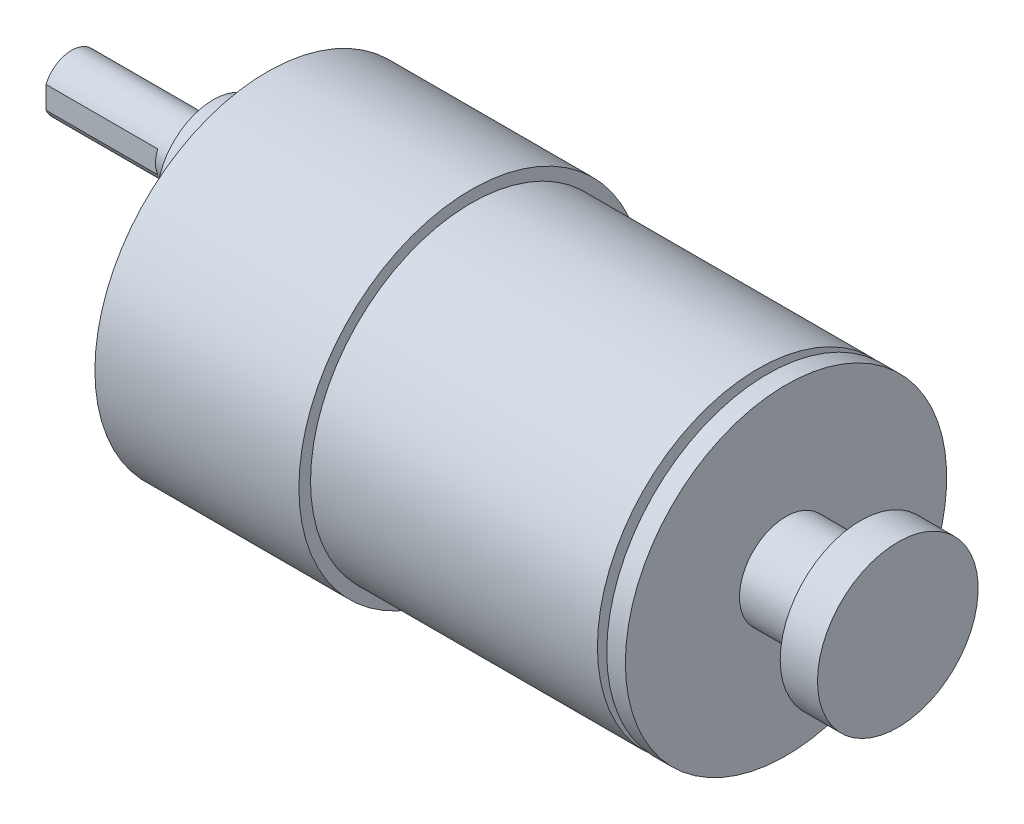
ISO-10303-21;
HEADER;
FILE_DESCRIPTION(('STEP AP214'),'2;1');
FILE_NAME('part.step','',(''),(''),'','','');
FILE_SCHEMA(('AUTOMOTIVE_DESIGN { 1 0 10303 214 1 1 1 1 }'));
ENDSEC;
DATA;
#1=APPLICATION_CONTEXT('core data for automotive mechanical design processes');
#2=APPLICATION_PROTOCOL_DEFINITION('international standard','automotive_design',2000,#1);
#3=PRODUCT_CONTEXT('',#1,'mechanical');
#4=PRODUCT('Part','Part','',(#3));
#5=PRODUCT_RELATED_PRODUCT_CATEGORY('part','',(#4));
#6=PRODUCT_DEFINITION_FORMATION('','',#4);
#7=PRODUCT_DEFINITION_CONTEXT('part definition',#1,'design');
#8=PRODUCT_DEFINITION('design','',#6,#7);
#9=PRODUCT_DEFINITION_SHAPE('','',#8);
#10=(LENGTH_UNIT() NAMED_UNIT(*) SI_UNIT(.MILLI.,.METRE.));
#11=(NAMED_UNIT(*) PLANE_ANGLE_UNIT() SI_UNIT($,.RADIAN.));
#12=(NAMED_UNIT(*) SI_UNIT($,.STERADIAN.) SOLID_ANGLE_UNIT());
#13=UNCERTAINTY_MEASURE_WITH_UNIT(LENGTH_MEASURE(1.E-05),#10,'distance_accuracy_value','');
#14=(GEOMETRIC_REPRESENTATION_CONTEXT(3) GLOBAL_UNCERTAINTY_ASSIGNED_CONTEXT((#13)) GLOBAL_UNIT_ASSIGNED_CONTEXT((#10,
#11,#12)) REPRESENTATION_CONTEXT('',''));
#15=CARTESIAN_POINT('',(0.,0.,0.));
#16=DIRECTION('',(0.,0.,1.));
#17=DIRECTION('',(1.,0.,0.));
#18=AXIS2_PLACEMENT_3D('',#15,#16,#17);
#19=CARTESIAN_POINT('',(-67.7,18.5,0.));
#20=DIRECTION('',(1.,0.,0.));
#21=DIRECTION('',(0.,0.,-1.));
#22=AXIS2_PLACEMENT_3D('',#19,#20,#21);
#23=PLANE('',#22);
#24=CARTESIAN_POINT('',(-67.7,0.,0.));
#25=DIRECTION('',(-1.,0.,0.));
#26=DIRECTION('',(0.,0.,1.));
#27=AXIS2_PLACEMENT_3D('',#24,#25,#26);
#28=CIRCLE('',#27,18.5);
#29=CARTESIAN_POINT('',(-67.7,0.,18.5));
#30=VERTEX_POINT('',#29);
#31=EDGE_CURVE('E207',#30,#30,#28,.T.);
#32=ORIENTED_EDGE('',*,*,#31,.T.);
#33=EDGE_LOOP('',(#32));
#34=FACE_BOUND('',#33,.T.);
#35=CARTESIAN_POINT('',(-67.7,6.99999999999999,0.));
#36=DIRECTION('',(1.,0.,0.));
#37=DIRECTION('',(0.,1.,0.));
#38=AXIS2_PLACEMENT_3D('',#35,#36,#37);
#39=CIRCLE('',#38,6.);
#40=CARTESIAN_POINT('',(-67.7,13.,0.));
#41=VERTEX_POINT('',#40);
#42=EDGE_CURVE('E204',#41,#41,#39,.T.);
#43=ORIENTED_EDGE('',*,*,#42,.T.);
#44=EDGE_LOOP('',(#43));
#45=FACE_BOUND('',#44,.T.);
#46=CARTESIAN_POINT('',(-67.7,13.4233937586587,7.75000000000016));
#47=DIRECTION('',(-1.,0.,0.));
#48=DIRECTION('',(0.,0.,1.));
#49=AXIS2_PLACEMENT_3D('',#46,#47,#48);
#50=CIRCLE('',#49,1.24999999999999);
#51=CARTESIAN_POINT('',(-67.7,13.4233937586587,9.00000000000015));
#52=VERTEX_POINT('',#51);
#53=EDGE_CURVE('E165',#52,#52,#50,.T.);
#54=ORIENTED_EDGE('',*,*,#53,.F.);
#55=EDGE_LOOP('',(#54));
#56=FACE_BOUND('',#55,.T.);
#57=CARTESIAN_POINT('',(-67.7,13.4233937586589,-7.74999999999987));
#58=DIRECTION('',(-1.,0.,0.));
#59=DIRECTION('',(0.,0.,1.));
#60=AXIS2_PLACEMENT_3D('',#57,#58,#59);
#61=CIRCLE('',#60,1.24999999999999);
#62=CARTESIAN_POINT('',(-67.7,13.4233937586589,-6.49999999999989));
#63=VERTEX_POINT('',#62);
#64=EDGE_CURVE('E159',#63,#63,#61,.T.);
#65=ORIENTED_EDGE('',*,*,#64,.F.);
#66=EDGE_LOOP('',(#65));
#67=FACE_BOUND('',#66,.T.);
#68=CARTESIAN_POINT('',(-67.7,1.08235921504137E-13,-15.5));
#69=DIRECTION('',(-1.,0.,0.));
#70=DIRECTION('',(0.,0.,1.));
#71=AXIS2_PLACEMENT_3D('',#68,#69,#70);
#72=CIRCLE('',#71,1.24999999999999);
#73=CARTESIAN_POINT('',(-67.7,1.08235921504137E-13,-14.25));
#74=VERTEX_POINT('',#73);
#75=EDGE_CURVE('E153',#74,#74,#72,.T.);
#76=ORIENTED_EDGE('',*,*,#75,.F.);
#77=EDGE_LOOP('',(#76));
#78=FACE_BOUND('',#77,.T.);
#79=CARTESIAN_POINT('',(-67.7,-13.4233937586588,-7.75000000000006));
#80=DIRECTION('',(-1.,0.,0.));
#81=DIRECTION('',(0.,0.,1.));
#82=AXIS2_PLACEMENT_3D('',#79,#80,#81);
#83=CIRCLE('',#82,1.24999999999999);
#84=CARTESIAN_POINT('',(-67.7,-13.4233937586588,-6.50000000000007));
#85=VERTEX_POINT('',#84);
#86=EDGE_CURVE('E147',#85,#85,#83,.T.);
#87=ORIENTED_EDGE('',*,*,#86,.F.);
#88=EDGE_LOOP('',(#87));
#89=FACE_BOUND('',#88,.T.);
#90=CARTESIAN_POINT('',(-67.7,-13.4233937586588,7.74999999999997));
#91=DIRECTION('',(-1.,0.,0.));
#92=DIRECTION('',(0.,0.,1.));
#93=AXIS2_PLACEMENT_3D('',#90,#91,#92);
#94=CIRCLE('',#93,1.24999999999999);
#95=CARTESIAN_POINT('',(-67.7,-13.4233937586588,8.99999999999996));
#96=VERTEX_POINT('',#95);
#97=EDGE_CURVE('E141',#96,#96,#94,.T.);
#98=ORIENTED_EDGE('',*,*,#97,.F.);
#99=EDGE_LOOP('',(#98));
#100=FACE_BOUND('',#99,.T.);
#101=CARTESIAN_POINT('',(-67.7,0.,15.5));
#102=DIRECTION('',(-1.,0.,0.));
#103=DIRECTION('',(0.,0.,1.));
#104=AXIS2_PLACEMENT_3D('',#101,#102,#103);
#105=CIRCLE('',#104,1.24999999999999);
#106=CARTESIAN_POINT('',(-67.7,0.,16.75));
#107=VERTEX_POINT('',#106);
#108=EDGE_CURVE('E134',#107,#107,#105,.T.);
#109=ORIENTED_EDGE('',*,*,#108,.F.);
#110=EDGE_LOOP('',(#109));
#111=FACE_BOUND('',#110,.T.);
#112=CARTESIAN_POINT('',(-67.7,6.99999999999999,0.));
#113=DIRECTION('',(-1.,0.,0.));
#114=DIRECTION('',(0.,0.,1.));
#115=AXIS2_PLACEMENT_3D('',#112,#113,#114);
#116=CIRCLE('',#115,9.34506746263185);
#117=CARTESIAN_POINT('',(-67.7,6.38547070420546,-9.32483992493977));
#118=VERTEX_POINT('',#117);
#119=CARTESIAN_POINT('',(-67.7,6.38547070420546,9.32483992493977));
#120=VERTEX_POINT('',#119);
#121=EDGE_CURVE('E59',#118,#120,#116,.T.);
#122=ORIENTED_EDGE('',*,*,#121,.T.);
#123=CARTESIAN_POINT('',(-67.7,0.,0.));
#124=DIRECTION('',(-1.,0.,0.));
#125=DIRECTION('',(0.,0.,1.));
#126=AXIS2_PLACEMENT_3D('',#123,#124,#125);
#127=CIRCLE('',#126,11.3016315521263);
#128=EDGE_CURVE('E127',#118,#120,#127,.T.);
#129=ORIENTED_EDGE('',*,*,#128,.F.);
#130=EDGE_LOOP('',(#122,#129));
#131=FACE_BOUND('',#130,.T.);
#132=ADVANCED_FACE('F44',(#34,#45,#56,#67,#78,#89,#100,#111,#131),#23,.F.);
#133=CARTESIAN_POINT('',(0.,7.,0.));
#134=DIRECTION('',(1.,0.,0.));
#135=DIRECTION('',(0.,1.,0.));
#136=AXIS2_PLACEMENT_3D('',#133,#134,#135);
#137=CYLINDRICAL_SURFACE('',#136,3.);
#138=CARTESIAN_POINT('',(-73.5,6.99999999999999,0.));
#139=DIRECTION('',(1.,0.,0.));
#140=DIRECTION('',(0.,1.,0.));
#141=AXIS2_PLACEMENT_3D('',#138,#139,#140);
#142=CIRCLE('',#141,3.);
#143=CARTESIAN_POINT('',(-73.5,9.99999999999999,0.));
#144=VERTEX_POINT('',#143);
#145=EDGE_CURVE('E198',#144,#144,#142,.T.);
#146=ORIENTED_EDGE('',*,*,#145,.F.);
#147=EDGE_LOOP('',(#146));
#148=FACE_BOUND('',#147,.T.);
#149=CARTESIAN_POINT('',(-76.7,6.99999999999999,0.));
#150=DIRECTION('',(-1.,0.,0.));
#151=DIRECTION('',(0.,0.,1.));
#152=AXIS2_PLACEMENT_3D('',#149,#150,#151);
#153=CIRCLE('',#152,3.);
#154=CARTESIAN_POINT('',(-76.7,8.19895788082817,-2.75));
#155=VERTEX_POINT('',#154);
#156=CARTESIAN_POINT('',(-76.7,5.80104211917181,-2.75));
#157=VERTEX_POINT('',#156);
#158=EDGE_CURVE('E174',#155,#157,#153,.T.);
#159=ORIENTED_EDGE('',*,*,#158,.F.);
#160=DIRECTION('',(-1.,0.,0.));
#161=VECTOR('',#160,1.);
#162=CARTESIAN_POINT('',(-76.7,8.19895788082817,-2.75));
#163=LINE('',#162,#161);
#164=CARTESIAN_POINT('',(-88.7,8.19895788082817,-2.75));
#165=VERTEX_POINT('',#164);
#166=EDGE_CURVE('E178',#155,#165,#163,.T.);
#167=ORIENTED_EDGE('',*,*,#166,.T.);
#168=CARTESIAN_POINT('',(-88.7,6.99999999999999,0.));
#169=DIRECTION('',(1.,0.,0.));
#170=DIRECTION('',(0.,1.,0.));
#171=AXIS2_PLACEMENT_3D('',#168,#169,#170);
#172=CIRCLE('',#171,3.);
#173=CARTESIAN_POINT('',(-88.7,8.19895788082817,2.75));
#174=VERTEX_POINT('',#173);
#175=EDGE_CURVE('E182',#165,#174,#172,.T.);
#176=ORIENTED_EDGE('',*,*,#175,.T.);
#177=DIRECTION('',(-1.,0.,0.));
#178=VECTOR('',#177,1.);
#179=CARTESIAN_POINT('',(-76.7,8.19895788082817,2.75));
#180=LINE('',#179,#178);
#181=CARTESIAN_POINT('',(-76.7,8.19895788082817,2.75));
#182=VERTEX_POINT('',#181);
#183=EDGE_CURVE('E190',#182,#174,#180,.T.);
#184=ORIENTED_EDGE('',*,*,#183,.F.);
#185=CARTESIAN_POINT('',(-76.7,6.99999999999999,0.));
#186=DIRECTION('',(-1.,0.,0.));
#187=DIRECTION('',(0.,0.,1.));
#188=AXIS2_PLACEMENT_3D('',#185,#186,#187);
#189=CIRCLE('',#188,3.);
#190=CARTESIAN_POINT('',(-76.7,5.80104211917181,2.75));
#191=VERTEX_POINT('',#190);
#192=EDGE_CURVE('E185',#191,#182,#189,.T.);
#193=ORIENTED_EDGE('',*,*,#192,.F.);
#194=DIRECTION('',(-1.,0.,0.));
#195=VECTOR('',#194,1.);
#196=CARTESIAN_POINT('',(-76.7,5.80104211917181,2.75));
#197=LINE('',#196,#195);
#198=CARTESIAN_POINT('',(-88.7,5.80104211917181,2.75));
#199=VERTEX_POINT('',#198);
#200=EDGE_CURVE('E180',#191,#199,#197,.T.);
#201=ORIENTED_EDGE('',*,*,#200,.T.);
#202=CARTESIAN_POINT('',(-88.7,5.80104211917181,-2.75));
#203=VERTEX_POINT('',#202);
#204=EDGE_CURVE('E197',#199,#203,#172,.T.);
#205=ORIENTED_EDGE('',*,*,#204,.T.);
#206=DIRECTION('',(-1.,0.,0.));
#207=VECTOR('',#206,1.);
#208=CARTESIAN_POINT('',(-76.7,5.80104211917181,-2.75));
#209=LINE('',#208,#207);
#210=EDGE_CURVE('E67',#157,#203,#209,.T.);
#211=ORIENTED_EDGE('',*,*,#210,.F.);
#212=EDGE_LOOP('',(#159,#167,#176,#184,#193,#201,#205,#211));
#213=FACE_BOUND('',#212,.T.);
#214=ADVANCED_FACE('F251',(#148,#213),#137,.T.);
#215=CARTESIAN_POINT('',(-88.7,9.99999999999999,0.));
#216=DIRECTION('',(-1.,0.,0.));
#217=DIRECTION('',(0.,-1.,0.));
#218=AXIS2_PLACEMENT_3D('',#215,#216,#217);
#219=PLANE('',#218);
#220=ORIENTED_EDGE('',*,*,#175,.F.);
#221=DIRECTION('',(0.,-1.,0.));
#222=VECTOR('',#221,1.);
#223=CARTESIAN_POINT('',(-88.7,0.,-2.75));
#224=LINE('',#223,#222);
#225=EDGE_CURVE('E175',#165,#203,#224,.T.);
#226=ORIENTED_EDGE('',*,*,#225,.T.);
#227=ORIENTED_EDGE('',*,*,#204,.F.);
#228=DIRECTION('',(0.,-1.,0.));
#229=VECTOR('',#228,1.);
#230=CARTESIAN_POINT('',(-88.7,0.,2.75));
#231=LINE('',#230,#229);
#232=EDGE_CURVE('E171',#174,#199,#231,.T.);
#233=ORIENTED_EDGE('',*,*,#232,.F.);
#234=EDGE_LOOP('',(#220,#226,#227,#233));
#235=FACE_BOUND('',#234,.T.);
#236=ADVANCED_FACE('F247',(#235),#219,.T.);
#237=CARTESIAN_POINT('',(0.,0.,0.));
#238=DIRECTION('',(-1.,0.,0.));
#239=DIRECTION('',(0.,0.,1.));
#240=AXIS2_PLACEMENT_3D('',#237,#238,#239);
#241=PLANE('',#240);
#242=CARTESIAN_POINT('',(0.,0.,0.));
#243=DIRECTION('',(-1.,0.,0.));
#244=DIRECTION('',(0.,0.,1.));
#245=AXIS2_PLACEMENT_3D('',#242,#243,#244);
#246=CIRCLE('',#245,8.625);
#247=CARTESIAN_POINT('',(0.,0.,8.625));
#248=VERTEX_POINT('',#247);
#249=EDGE_CURVE('E11',#248,#248,#246,.T.);
#250=ORIENTED_EDGE('',*,*,#249,.F.);
#251=EDGE_LOOP('',(#250));
#252=FACE_BOUND('',#251,.T.);
#253=ADVANCED_FACE('F46',(#252),#241,.F.);
#254=CARTESIAN_POINT('',(-80.111398028132,0.,0.));
#255=DIRECTION('',(-1.,0.,0.));
#256=DIRECTION('',(0.,0.,1.));
#257=AXIS2_PLACEMENT_3D('',#254,#255,#256);
#258=CYLINDRICAL_SURFACE('',#257,8.625);
#259=CARTESIAN_POINT('',(-4.,0.,0.));
#260=DIRECTION('',(-1.,0.,0.));
#261=DIRECTION('',(0.,0.,1.));
#262=AXIS2_PLACEMENT_3D('',#259,#260,#261);
#263=CIRCLE('',#262,8.625);
#264=CARTESIAN_POINT('',(-4.,0.,8.625));
#265=VERTEX_POINT('',#264);
#266=EDGE_CURVE('E52',#265,#265,#263,.T.);
#267=ORIENTED_EDGE('',*,*,#266,.F.);
#268=EDGE_LOOP('',(#267));
#269=FACE_BOUND('',#268,.T.);
#270=ORIENTED_EDGE('',*,*,#249,.T.);
#271=EDGE_LOOP('',(#270));
#272=FACE_BOUND('',#271,.T.);
#273=ADVANCED_FACE('F241',(#269,#272),#258,.T.);
#274=CARTESIAN_POINT('',(-4.,8.625,0.));
#275=DIRECTION('',(1.,0.,0.));
#276=DIRECTION('',(0.,0.,-1.));
#277=AXIS2_PLACEMENT_3D('',#274,#275,#276);
#278=PLANE('',#277);
#279=CARTESIAN_POINT('',(-4.,0.,0.));
#280=DIRECTION('',(-1.,0.,0.));
#281=DIRECTION('',(0.,0.,1.));
#282=AXIS2_PLACEMENT_3D('',#279,#280,#281);
#283=CIRCLE('',#282,5.);
#284=CARTESIAN_POINT('',(-4.,0.,5.));
#285=VERTEX_POINT('',#284);
#286=EDGE_CURVE('E234',#285,#285,#283,.T.);
#287=ORIENTED_EDGE('',*,*,#286,.F.);
#288=EDGE_LOOP('',(#287));
#289=FACE_BOUND('',#288,.T.);
#290=ORIENTED_EDGE('',*,*,#266,.T.);
#291=EDGE_LOOP('',(#290));
#292=FACE_BOUND('',#291,.T.);
#293=ADVANCED_FACE('F239',(#289,#292),#278,.F.);
#294=CARTESIAN_POINT('',(-80.111398028132,0.,0.));
#295=DIRECTION('',(-1.,0.,0.));
#296=DIRECTION('',(0.,0.,1.));
#297=AXIS2_PLACEMENT_3D('',#294,#295,#296);
#298=CYLINDRICAL_SURFACE('',#297,5.);
#299=CARTESIAN_POINT('',(-12.,0.,0.));
#300=DIRECTION('',(-1.,0.,0.));
#301=DIRECTION('',(0.,0.,1.));
#302=AXIS2_PLACEMENT_3D('',#299,#300,#301);
#303=CIRCLE('',#302,5.);
#304=CARTESIAN_POINT('',(-12.,0.,5.));
#305=VERTEX_POINT('',#304);
#306=EDGE_CURVE('E231',#305,#305,#303,.T.);
#307=ORIENTED_EDGE('',*,*,#306,.F.);
#308=EDGE_LOOP('',(#307));
#309=FACE_BOUND('',#308,.T.);
#310=ORIENTED_EDGE('',*,*,#286,.T.);
#311=EDGE_LOOP('',(#310));
#312=FACE_BOUND('',#311,.T.);
#313=ADVANCED_FACE('F298',(#309,#312),#298,.T.);
#314=CARTESIAN_POINT('',(-12.,5.,0.));
#315=DIRECTION('',(-1.,0.,0.));
#316=DIRECTION('',(0.,0.,1.));
#317=AXIS2_PLACEMENT_3D('',#314,#315,#316);
#318=PLANE('',#317);
#319=CARTESIAN_POINT('',(-12.,0.,0.));
#320=DIRECTION('',(-1.,0.,0.));
#321=DIRECTION('',(0.,0.,1.));
#322=AXIS2_PLACEMENT_3D('',#319,#320,#321);
#323=CIRCLE('',#322,17.25);
#324=CARTESIAN_POINT('',(-12.,0.,17.25));
#325=VERTEX_POINT('',#324);
#326=EDGE_CURVE('E228',#325,#325,#323,.T.);
#327=ORIENTED_EDGE('',*,*,#326,.F.);
#328=EDGE_LOOP('',(#327));
#329=FACE_BOUND('',#328,.T.);
#330=ORIENTED_EDGE('',*,*,#306,.T.);
#331=EDGE_LOOP('',(#330));
#332=FACE_BOUND('',#331,.T.);
#333=ADVANCED_FACE('F294',(#329,#332),#318,.F.);
#334=CARTESIAN_POINT('',(-80.111398028132,0.,0.));
#335=DIRECTION('',(-1.,0.,0.));
#336=DIRECTION('',(0.,0.,1.));
#337=AXIS2_PLACEMENT_3D('',#334,#335,#336);
#338=CYLINDRICAL_SURFACE('',#337,17.25);
#339=CARTESIAN_POINT('',(-14.,0.,0.));
#340=DIRECTION('',(-1.,0.,0.));
#341=DIRECTION('',(0.,0.,1.));
#342=AXIS2_PLACEMENT_3D('',#339,#340,#341);
#343=CIRCLE('',#342,17.25);
#344=CARTESIAN_POINT('',(-14.,0.,17.25));
#345=VERTEX_POINT('',#344);
#346=EDGE_CURVE('E225',#345,#345,#343,.T.);
#347=ORIENTED_EDGE('',*,*,#346,.F.);
#348=EDGE_LOOP('',(#347));
#349=FACE_BOUND('',#348,.T.);
#350=ORIENTED_EDGE('',*,*,#326,.T.);
#351=EDGE_LOOP('',(#350));
#352=FACE_BOUND('',#351,.T.);
#353=ADVANCED_FACE('F290',(#349,#352),#338,.T.);
#354=CARTESIAN_POINT('',(-14.,17.25,0.));
#355=DIRECTION('',(1.,0.,0.));
#356=DIRECTION('',(0.,0.,-1.));
#357=AXIS2_PLACEMENT_3D('',#354,#355,#356);
#358=PLANE('',#357);
#359=CARTESIAN_POINT('',(-14.,0.,0.));
#360=DIRECTION('',(-1.,0.,0.));
#361=DIRECTION('',(0.,0.,1.));
#362=AXIS2_PLACEMENT_3D('',#359,#360,#361);
#363=CIRCLE('',#362,5.);
#364=CARTESIAN_POINT('',(-14.,0.,5.));
#365=VERTEX_POINT('',#364);
#366=EDGE_CURVE('E222',#365,#365,#363,.T.);
#367=ORIENTED_EDGE('',*,*,#366,.F.);
#368=EDGE_LOOP('',(#367));
#369=FACE_BOUND('',#368,.T.);
#370=ORIENTED_EDGE('',*,*,#346,.T.);
#371=EDGE_LOOP('',(#370));
#372=FACE_BOUND('',#371,.T.);
#373=ADVANCED_FACE('F286',(#369,#372),#358,.F.);
#374=CARTESIAN_POINT('',(-80.111398028132,0.,0.));
#375=DIRECTION('',(-1.,0.,0.));
#376=DIRECTION('',(0.,0.,1.));
#377=AXIS2_PLACEMENT_3D('',#374,#375,#376);
#378=CYLINDRICAL_SURFACE('',#377,5.);
#379=CARTESIAN_POINT('',(-15.,0.,0.));
#380=DIRECTION('',(-1.,0.,0.));
#381=DIRECTION('',(0.,0.,1.));
#382=AXIS2_PLACEMENT_3D('',#379,#380,#381);
#383=CIRCLE('',#382,5.);
#384=CARTESIAN_POINT('',(-15.,0.,5.));
#385=VERTEX_POINT('',#384);
#386=EDGE_CURVE('E219',#385,#385,#383,.T.);
#387=ORIENTED_EDGE('',*,*,#386,.F.);
#388=EDGE_LOOP('',(#387));
#389=FACE_BOUND('',#388,.T.);
#390=ORIENTED_EDGE('',*,*,#366,.T.);
#391=EDGE_LOOP('',(#390));
#392=FACE_BOUND('',#391,.T.);
#393=ADVANCED_FACE('F282',(#389,#392),#378,.T.);
#394=CARTESIAN_POINT('',(-15.,5.,0.));
#395=DIRECTION('',(-1.,0.,0.));
#396=DIRECTION('',(0.,0.,1.));
#397=AXIS2_PLACEMENT_3D('',#394,#395,#396);
#398=PLANE('',#397);
#399=CARTESIAN_POINT('',(-15.,0.,0.));
#400=DIRECTION('',(-1.,0.,0.));
#401=DIRECTION('',(0.,0.,1.));
#402=AXIS2_PLACEMENT_3D('',#399,#400,#401);
#403=CIRCLE('',#402,17.25);
#404=CARTESIAN_POINT('',(-15.,0.,17.25));
#405=VERTEX_POINT('',#404);
#406=EDGE_CURVE('E216',#405,#405,#403,.T.);
#407=ORIENTED_EDGE('',*,*,#406,.F.);
#408=EDGE_LOOP('',(#407));
#409=FACE_BOUND('',#408,.T.);
#410=ORIENTED_EDGE('',*,*,#386,.T.);
#411=EDGE_LOOP('',(#410));
#412=FACE_BOUND('',#411,.T.);
#413=ADVANCED_FACE('F278',(#409,#412),#398,.F.);
#414=CARTESIAN_POINT('',(-80.111398028132,0.,0.));
#415=DIRECTION('',(-1.,0.,0.));
#416=DIRECTION('',(0.,0.,1.));
#417=AXIS2_PLACEMENT_3D('',#414,#415,#416);
#418=CYLINDRICAL_SURFACE('',#417,17.25);
#419=CARTESIAN_POINT('',(-45.8,0.,0.));
#420=DIRECTION('',(-1.,0.,0.));
#421=DIRECTION('',(0.,0.,1.));
#422=AXIS2_PLACEMENT_3D('',#419,#420,#421);
#423=CIRCLE('',#422,17.25);
#424=CARTESIAN_POINT('',(-45.8,0.,17.25));
#425=VERTEX_POINT('',#424);
#426=EDGE_CURVE('E213',#425,#425,#423,.T.);
#427=ORIENTED_EDGE('',*,*,#426,.F.);
#428=EDGE_LOOP('',(#427));
#429=FACE_BOUND('',#428,.T.);
#430=ORIENTED_EDGE('',*,*,#406,.T.);
#431=EDGE_LOOP('',(#430));
#432=FACE_BOUND('',#431,.T.);
#433=ADVANCED_FACE('F274',(#429,#432),#418,.T.);
#434=CARTESIAN_POINT('',(-45.8,17.25,0.));
#435=DIRECTION('',(-1.,0.,0.));
#436=DIRECTION('',(0.,0.,1.));
#437=AXIS2_PLACEMENT_3D('',#434,#435,#436);
#438=PLANE('',#437);
#439=CARTESIAN_POINT('',(-45.8,0.,0.));
#440=DIRECTION('',(-1.,0.,0.));
#441=DIRECTION('',(0.,0.,1.));
#442=AXIS2_PLACEMENT_3D('',#439,#440,#441);
#443=CIRCLE('',#442,18.5);
#444=CARTESIAN_POINT('',(-45.8,0.,18.5));
#445=VERTEX_POINT('',#444);
#446=EDGE_CURVE('E210',#445,#445,#443,.T.);
#447=ORIENTED_EDGE('',*,*,#446,.F.);
#448=EDGE_LOOP('',(#447));
#449=FACE_BOUND('',#448,.T.);
#450=ORIENTED_EDGE('',*,*,#426,.T.);
#451=EDGE_LOOP('',(#450));
#452=FACE_BOUND('',#451,.T.);
#453=ADVANCED_FACE('F270',(#449,#452),#438,.F.);
#454=CARTESIAN_POINT('',(-80.111398028132,0.,0.));
#455=DIRECTION('',(-1.,0.,0.));
#456=DIRECTION('',(0.,0.,1.));
#457=AXIS2_PLACEMENT_3D('',#454,#455,#456);
#458=CYLINDRICAL_SURFACE('',#457,18.5);
#459=ORIENTED_EDGE('',*,*,#31,.F.);
#460=EDGE_LOOP('',(#459));
#461=FACE_BOUND('',#460,.T.);
#462=ORIENTED_EDGE('',*,*,#446,.T.);
#463=EDGE_LOOP('',(#462));
#464=FACE_BOUND('',#463,.T.);
#465=ADVANCED_FACE('F267',(#461,#464),#458,.T.);
#466=CARTESIAN_POINT('',(0.,7.,0.));
#467=DIRECTION('',(1.,0.,0.));
#468=DIRECTION('',(0.,1.,0.));
#469=AXIS2_PLACEMENT_3D('',#466,#467,#468);
#470=CYLINDRICAL_SURFACE('',#469,6.);
#471=CARTESIAN_POINT('',(-73.5,6.99999999999999,0.));
#472=DIRECTION('',(1.,0.,0.));
#473=DIRECTION('',(0.,1.,0.));
#474=AXIS2_PLACEMENT_3D('',#471,#472,#473);
#475=CIRCLE('',#474,6.);
#476=CARTESIAN_POINT('',(-73.5,13.,0.));
#477=VERTEX_POINT('',#476);
#478=EDGE_CURVE('E201',#477,#477,#475,.T.);
#479=ORIENTED_EDGE('',*,*,#478,.T.);
#480=EDGE_LOOP('',(#479));
#481=FACE_BOUND('',#480,.T.);
#482=ORIENTED_EDGE('',*,*,#42,.F.);
#483=EDGE_LOOP('',(#482));
#484=FACE_BOUND('',#483,.T.);
#485=ADVANCED_FACE('F265',(#481,#484),#470,.T.);
#486=CARTESIAN_POINT('',(-73.5,13.,0.));
#487=DIRECTION('',(-1.,0.,0.));
#488=DIRECTION('',(0.,-1.,0.));
#489=AXIS2_PLACEMENT_3D('',#486,#487,#488);
#490=PLANE('',#489);
#491=ORIENTED_EDGE('',*,*,#145,.T.);
#492=EDGE_LOOP('',(#491));
#493=FACE_BOUND('',#492,.T.);
#494=ORIENTED_EDGE('',*,*,#478,.F.);
#495=EDGE_LOOP('',(#494));
#496=FACE_BOUND('',#495,.T.);
#497=ADVANCED_FACE('F363',(#493,#496),#490,.T.);
#498=CARTESIAN_POINT('',(-76.7,0.,2.75));
#499=DIRECTION('',(0.,0.,-1.));
#500=DIRECTION('',(0.,1.,0.));
#501=AXIS2_PLACEMENT_3D('',#498,#499,#500);
#502=PLANE('',#501);
#503=ORIENTED_EDGE('',*,*,#232,.T.);
#504=ORIENTED_EDGE('',*,*,#200,.F.);
#505=DIRECTION('',(0.,-1.,0.));
#506=VECTOR('',#505,1.);
#507=CARTESIAN_POINT('',(-76.7,0.,2.75));
#508=LINE('',#507,#506);
#509=EDGE_CURVE('E187',#182,#191,#508,.T.);
#510=ORIENTED_EDGE('',*,*,#509,.F.);
#511=ORIENTED_EDGE('',*,*,#183,.T.);
#512=EDGE_LOOP('',(#503,#504,#510,#511));
#513=FACE_BOUND('',#512,.T.);
#514=ADVANCED_FACE('F369',(#513),#502,.F.);
#515=CARTESIAN_POINT('',(-76.7,0.,0.));
#516=DIRECTION('',(-1.,0.,0.));
#517=DIRECTION('',(0.,0.,1.));
#518=AXIS2_PLACEMENT_3D('',#515,#516,#517);
#519=PLANE('',#518);
#520=ORIENTED_EDGE('',*,*,#192,.T.);
#521=ORIENTED_EDGE('',*,*,#509,.T.);
#522=EDGE_LOOP('',(#520,#521));
#523=FACE_BOUND('',#522,.T.);
#524=ADVANCED_FACE('F375',(#523),#519,.T.);
#525=CARTESIAN_POINT('',(-76.7,0.,-2.75));
#526=DIRECTION('',(0.,0.,-1.));
#527=DIRECTION('',(0.,1.,0.));
#528=AXIS2_PLACEMENT_3D('',#525,#526,#527);
#529=PLANE('',#528);
#530=ORIENTED_EDGE('',*,*,#225,.F.);
#531=ORIENTED_EDGE('',*,*,#166,.F.);
#532=DIRECTION('',(0.,-1.,0.));
#533=VECTOR('',#532,1.);
#534=CARTESIAN_POINT('',(-76.7,0.,-2.75));
#535=LINE('',#534,#533);
#536=EDGE_CURVE('E172',#155,#157,#535,.T.);
#537=ORIENTED_EDGE('',*,*,#536,.T.);
#538=ORIENTED_EDGE('',*,*,#210,.T.);
#539=EDGE_LOOP('',(#530,#531,#537,#538));
#540=FACE_BOUND('',#539,.T.);
#541=ADVANCED_FACE('F383',(#540),#529,.T.);
#542=CARTESIAN_POINT('',(-76.7,0.,0.));
#543=DIRECTION('',(-1.,0.,0.));
#544=DIRECTION('',(0.,0.,1.));
#545=AXIS2_PLACEMENT_3D('',#542,#543,#544);
#546=PLANE('',#545);
#547=ORIENTED_EDGE('',*,*,#536,.F.);
#548=ORIENTED_EDGE('',*,*,#158,.T.);
#549=EDGE_LOOP('',(#547,#548));
#550=FACE_BOUND('',#549,.T.);
#551=ADVANCED_FACE('F391',(#550),#546,.T.);
#552=CARTESIAN_POINT('',(-59.2,13.4233937586587,7.75000000000016));
#553=DIRECTION('',(-1.,0.,0.));
#554=DIRECTION('',(0.,0.,1.));
#555=AXIS2_PLACEMENT_3D('',#552,#553,#554);
#556=CONICAL_SURFACE('',#555,1.25,1.02974425867665);
#557=CARTESIAN_POINT('',(-58.4489242262156,13.4233937586587,7.75000000000016));
#558=VERTEX_POINT('',#557);
#559=VERTEX_LOOP('',#558);
#560=FACE_BOUND('',#559,.T.);
#561=CARTESIAN_POINT('',(-59.2,13.4233937586587,7.75000000000016));
#562=DIRECTION('',(-1.,0.,0.));
#563=DIRECTION('',(0.,0.,1.));
#564=AXIS2_PLACEMENT_3D('',#561,#562,#563);
#565=CIRCLE('',#564,1.25);
#566=CARTESIAN_POINT('',(-59.2,13.4233937586587,9.00000000000016));
#567=VERTEX_POINT('',#566);
#568=EDGE_CURVE('E168',#567,#567,#565,.T.);
#569=ORIENTED_EDGE('',*,*,#568,.T.);
#570=EDGE_LOOP('',(#569));
#571=FACE_BOUND('',#570,.T.);
#572=ADVANCED_FACE('F398',(#560,#571),#556,.F.);
#573=CARTESIAN_POINT('',(-67.7,13.4233937586587,7.75000000000016));
#574=DIRECTION('',(-1.,0.,0.));
#575=DIRECTION('',(0.,0.,1.));
#576=AXIS2_PLACEMENT_3D('',#573,#574,#575);
#577=CYLINDRICAL_SURFACE('',#576,1.24999999999999);
#578=ORIENTED_EDGE('',*,*,#568,.F.);
#579=EDGE_LOOP('',(#578));
#580=FACE_BOUND('',#579,.T.);
#581=ORIENTED_EDGE('',*,*,#53,.T.);
#582=EDGE_LOOP('',(#581));
#583=FACE_BOUND('',#582,.T.);
#584=ADVANCED_FACE('F406',(#580,#583),#577,.F.);
#585=CARTESIAN_POINT('',(-59.2,13.4233937586589,-7.74999999999987));
#586=DIRECTION('',(-1.,0.,0.));
#587=DIRECTION('',(0.,0.,1.));
#588=AXIS2_PLACEMENT_3D('',#585,#586,#587);
#589=CONICAL_SURFACE('',#588,1.25,1.02974425867665);
#590=CARTESIAN_POINT('',(-58.4489242262156,13.4233937586589,-7.74999999999987));
#591=VERTEX_POINT('',#590);
#592=VERTEX_LOOP('',#591);
#593=FACE_BOUND('',#592,.T.);
#594=CARTESIAN_POINT('',(-59.2,13.4233937586589,-7.74999999999987));
#595=DIRECTION('',(-1.,0.,0.));
#596=DIRECTION('',(0.,0.,1.));
#597=AXIS2_PLACEMENT_3D('',#594,#595,#596);
#598=CIRCLE('',#597,1.25);
#599=CARTESIAN_POINT('',(-59.2,13.4233937586589,-6.49999999999988));
#600=VERTEX_POINT('',#599);
#601=EDGE_CURVE('E162',#600,#600,#598,.T.);
#602=ORIENTED_EDGE('',*,*,#601,.T.);
#603=EDGE_LOOP('',(#602));
#604=FACE_BOUND('',#603,.T.);
#605=ADVANCED_FACE('F416',(#593,#604),#589,.F.);
#606=CARTESIAN_POINT('',(-67.7,13.4233937586589,-7.74999999999987));
#607=DIRECTION('',(-1.,0.,0.));
#608=DIRECTION('',(0.,0.,1.));
#609=AXIS2_PLACEMENT_3D('',#606,#607,#608);
#610=CYLINDRICAL_SURFACE('',#609,1.24999999999999);
#611=ORIENTED_EDGE('',*,*,#601,.F.);
#612=EDGE_LOOP('',(#611));
#613=FACE_BOUND('',#612,.T.);
#614=ORIENTED_EDGE('',*,*,#64,.T.);
#615=EDGE_LOOP('',(#614));
#616=FACE_BOUND('',#615,.T.);
#617=ADVANCED_FACE('F428',(#613,#616),#610,.F.);
#618=CARTESIAN_POINT('',(-59.2,1.08235921504137E-13,-15.5));
#619=DIRECTION('',(-1.,0.,0.));
#620=DIRECTION('',(0.,0.,1.));
#621=AXIS2_PLACEMENT_3D('',#618,#619,#620);
#622=CONICAL_SURFACE('',#621,1.25,1.02974425867665);
#623=CARTESIAN_POINT('',(-58.4489242262156,1.0597006143713E-13,-15.5));
#624=VERTEX_POINT('',#623);
#625=VERTEX_LOOP('',#624);
#626=FACE_BOUND('',#625,.T.);
#627=CARTESIAN_POINT('',(-59.2,1.08235921504137E-13,-15.5));
#628=DIRECTION('',(-1.,0.,0.));
#629=DIRECTION('',(0.,0.,1.));
#630=AXIS2_PLACEMENT_3D('',#627,#628,#629);
#631=CIRCLE('',#630,1.25);
#632=CARTESIAN_POINT('',(-59.2,1.08235921504137E-13,-14.25));
#633=VERTEX_POINT('',#632);
#634=EDGE_CURVE('E156',#633,#633,#631,.T.);
#635=ORIENTED_EDGE('',*,*,#634,.T.);
#636=EDGE_LOOP('',(#635));
#637=FACE_BOUND('',#636,.T.);
#638=ADVANCED_FACE('F436',(#626,#637),#622,.F.);
#639=CARTESIAN_POINT('',(-67.7,1.08235921504137E-13,-15.5));
#640=DIRECTION('',(-1.,0.,0.));
#641=DIRECTION('',(0.,0.,1.));
#642=AXIS2_PLACEMENT_3D('',#639,#640,#641);
#643=CYLINDRICAL_SURFACE('',#642,1.24999999999999);
#644=ORIENTED_EDGE('',*,*,#634,.F.);
#645=EDGE_LOOP('',(#644));
#646=FACE_BOUND('',#645,.T.);
#647=ORIENTED_EDGE('',*,*,#75,.T.);
#648=EDGE_LOOP('',(#647));
#649=FACE_BOUND('',#648,.T.);
#650=ADVANCED_FACE('F447',(#646,#649),#643,.F.);
#651=CARTESIAN_POINT('',(-59.2,-13.4233937586588,-7.75000000000006));
#652=DIRECTION('',(-1.,0.,0.));
#653=DIRECTION('',(0.,0.,1.));
#654=AXIS2_PLACEMENT_3D('',#651,#652,#653);
#655=CONICAL_SURFACE('',#654,1.25,1.02974425867665);
#656=CARTESIAN_POINT('',(-58.4489242262156,-13.4233937586588,-7.75000000000006));
#657=VERTEX_POINT('',#656);
#658=VERTEX_LOOP('',#657);
#659=FACE_BOUND('',#658,.T.);
#660=CARTESIAN_POINT('',(-59.2,-13.4233937586588,-7.75000000000006));
#661=DIRECTION('',(-1.,0.,0.));
#662=DIRECTION('',(0.,0.,1.));
#663=AXIS2_PLACEMENT_3D('',#660,#661,#662);
#664=CIRCLE('',#663,1.25);
#665=CARTESIAN_POINT('',(-59.2,-13.4233937586588,-6.50000000000006));
#666=VERTEX_POINT('',#665);
#667=EDGE_CURVE('E150',#666,#666,#664,.T.);
#668=ORIENTED_EDGE('',*,*,#667,.T.);
#669=EDGE_LOOP('',(#668));
#670=FACE_BOUND('',#669,.T.);
#671=ADVANCED_FACE('F455',(#659,#670),#655,.F.);
#672=CARTESIAN_POINT('',(-67.7,-13.4233937586588,-7.75000000000006));
#673=DIRECTION('',(-1.,0.,0.));
#674=DIRECTION('',(0.,0.,1.));
#675=AXIS2_PLACEMENT_3D('',#672,#673,#674);
#676=CYLINDRICAL_SURFACE('',#675,1.24999999999999);
#677=ORIENTED_EDGE('',*,*,#667,.F.);
#678=EDGE_LOOP('',(#677));
#679=FACE_BOUND('',#678,.T.);
#680=ORIENTED_EDGE('',*,*,#86,.T.);
#681=EDGE_LOOP('',(#680));
#682=FACE_BOUND('',#681,.T.);
#683=ADVANCED_FACE('F466',(#679,#682),#676,.F.);
#684=CARTESIAN_POINT('',(-59.2,-13.4233937586588,7.74999999999997));
#685=DIRECTION('',(-1.,0.,0.));
#686=DIRECTION('',(0.,0.,1.));
#687=AXIS2_PLACEMENT_3D('',#684,#685,#686);
#688=CONICAL_SURFACE('',#687,1.25,1.02974425867665);
#689=CARTESIAN_POINT('',(-58.4489242262156,-13.4233937586588,7.74999999999997));
#690=VERTEX_POINT('',#689);
#691=VERTEX_LOOP('',#690);
#692=FACE_BOUND('',#691,.T.);
#693=CARTESIAN_POINT('',(-59.2,-13.4233937586588,7.74999999999997));
#694=DIRECTION('',(-1.,0.,0.));
#695=DIRECTION('',(0.,0.,1.));
#696=AXIS2_PLACEMENT_3D('',#693,#694,#695);
#697=CIRCLE('',#696,1.25);
#698=CARTESIAN_POINT('',(-59.2,-13.4233937586588,8.99999999999997));
#699=VERTEX_POINT('',#698);
#700=EDGE_CURVE('E144',#699,#699,#697,.T.);
#701=ORIENTED_EDGE('',*,*,#700,.T.);
#702=EDGE_LOOP('',(#701));
#703=FACE_BOUND('',#702,.T.);
#704=ADVANCED_FACE('F474',(#692,#703),#688,.F.);
#705=CARTESIAN_POINT('',(-67.7,-13.4233937586588,7.74999999999997));
#706=DIRECTION('',(-1.,0.,0.));
#707=DIRECTION('',(0.,0.,1.));
#708=AXIS2_PLACEMENT_3D('',#705,#706,#707);
#709=CYLINDRICAL_SURFACE('',#708,1.24999999999999);
#710=ORIENTED_EDGE('',*,*,#700,.F.);
#711=EDGE_LOOP('',(#710));
#712=FACE_BOUND('',#711,.T.);
#713=ORIENTED_EDGE('',*,*,#97,.T.);
#714=EDGE_LOOP('',(#713));
#715=FACE_BOUND('',#714,.T.);
#716=ADVANCED_FACE('F485',(#712,#715),#709,.F.);
#717=CARTESIAN_POINT('',(-59.2,0.,15.5));
#718=DIRECTION('',(-1.,0.,0.));
#719=DIRECTION('',(0.,0.,1.));
#720=AXIS2_PLACEMENT_3D('',#717,#718,#719);
#721=CONICAL_SURFACE('',#720,1.25,1.02974425867665);
#722=CARTESIAN_POINT('',(-58.4489242262156,0.,15.5));
#723=VERTEX_POINT('',#722);
#724=VERTEX_LOOP('',#723);
#725=FACE_BOUND('',#724,.T.);
#726=CARTESIAN_POINT('',(-59.2,0.,15.5));
#727=DIRECTION('',(-1.,0.,0.));
#728=DIRECTION('',(0.,0.,1.));
#729=AXIS2_PLACEMENT_3D('',#726,#727,#728);
#730=CIRCLE('',#729,1.25);
#731=CARTESIAN_POINT('',(-59.2,0.,16.75));
#732=VERTEX_POINT('',#731);
#733=EDGE_CURVE('E138',#732,#732,#730,.T.);
#734=ORIENTED_EDGE('',*,*,#733,.T.);
#735=EDGE_LOOP('',(#734));
#736=FACE_BOUND('',#735,.T.);
#737=ADVANCED_FACE('F493',(#725,#736),#721,.F.);
#738=CARTESIAN_POINT('',(-67.7,0.,15.5));
#739=DIRECTION('',(-1.,0.,0.));
#740=DIRECTION('',(0.,0.,1.));
#741=AXIS2_PLACEMENT_3D('',#738,#739,#740);
#742=CYLINDRICAL_SURFACE('',#741,1.24999999999999);
#743=ORIENTED_EDGE('',*,*,#733,.F.);
#744=EDGE_LOOP('',(#743));
#745=FACE_BOUND('',#744,.T.);
#746=ORIENTED_EDGE('',*,*,#108,.T.);
#747=EDGE_LOOP('',(#746));
#748=FACE_BOUND('',#747,.T.);
#749=ADVANCED_FACE('F503',(#745,#748),#742,.F.);
#750=CARTESIAN_POINT('',(-65.7,6.99999999999999,0.));
#751=DIRECTION('',(-1.,0.,0.));
#752=DIRECTION('',(0.,0.,1.));
#753=AXIS2_PLACEMENT_3D('',#750,#751,#752);
#754=CYLINDRICAL_SURFACE('',#753,9.34506746263185);
#755=ORIENTED_EDGE('',*,*,#121,.F.);
#756=DIRECTION('',(-1.,0.,0.));
#757=VECTOR('',#756,1.);
#758=CARTESIAN_POINT('',(-65.7,6.38547070420546,-9.32483992493977));
#759=LINE('',#758,#757);
#760=CARTESIAN_POINT('',(-65.7,6.38547070420546,-9.32483992493977));
#761=VERTEX_POINT('',#760);
#762=EDGE_CURVE('E112',#761,#118,#759,.T.);
#763=ORIENTED_EDGE('',*,*,#762,.F.);
#764=CARTESIAN_POINT('',(-65.7,6.99999999999999,0.));
#765=DIRECTION('',(-1.,0.,0.));
#766=DIRECTION('',(0.,0.,1.));
#767=AXIS2_PLACEMENT_3D('',#764,#765,#766);
#768=CIRCLE('',#767,9.34506746263185);
#769=CARTESIAN_POINT('',(-65.7,6.38547070420546,9.32483992493977));
#770=VERTEX_POINT('',#769);
#771=EDGE_CURVE('E115',#761,#770,#768,.T.);
#772=ORIENTED_EDGE('',*,*,#771,.T.);
#773=DIRECTION('',(-1.,0.,0.));
#774=VECTOR('',#773,1.);
#775=CARTESIAN_POINT('',(-65.7,6.38547070420546,9.32483992493977));
#776=LINE('',#775,#774);
#777=EDGE_CURVE('E121',#770,#120,#776,.T.);
#778=ORIENTED_EDGE('',*,*,#777,.T.);
#779=EDGE_LOOP('',(#755,#763,#772,#778));
#780=FACE_BOUND('',#779,.T.);
#781=ADVANCED_FACE('F114',(#780),#754,.T.);
#782=CARTESIAN_POINT('',(-65.7,0.,0.));
#783=DIRECTION('',(-1.,0.,0.));
#784=DIRECTION('',(0.,0.,1.));
#785=AXIS2_PLACEMENT_3D('',#782,#783,#784);
#786=CYLINDRICAL_SURFACE('',#785,11.3016315521263);
#787=ORIENTED_EDGE('',*,*,#128,.T.);
#788=ORIENTED_EDGE('',*,*,#777,.F.);
#789=CARTESIAN_POINT('',(-65.7,0.,0.));
#790=DIRECTION('',(-1.,0.,0.));
#791=DIRECTION('',(0.,0.,1.));
#792=AXIS2_PLACEMENT_3D('',#789,#790,#791);
#793=CIRCLE('',#792,11.3016315521263);
#794=EDGE_CURVE('E122',#761,#770,#793,.T.);
#795=ORIENTED_EDGE('',*,*,#794,.F.);
#796=ORIENTED_EDGE('',*,*,#762,.T.);
#797=EDGE_LOOP('',(#787,#788,#795,#796));
#798=FACE_BOUND('',#797,.T.);
#799=ADVANCED_FACE('F129',(#798),#786,.F.);
#800=CARTESIAN_POINT('',(-65.7,0.,0.));
#801=DIRECTION('',(-1.,0.,0.));
#802=DIRECTION('',(0.,0.,1.));
#803=AXIS2_PLACEMENT_3D('',#800,#801,#802);
#804=PLANE('',#803);
#805=ORIENTED_EDGE('',*,*,#771,.F.);
#806=ORIENTED_EDGE('',*,*,#794,.T.);
#807=EDGE_LOOP('',(#805,#806));
#808=FACE_BOUND('',#807,.T.);
#809=ADVANCED_FACE('F126',(#808),#804,.T.);
#810=CLOSED_SHELL('',(#132,#214,#236,#253,#273,#293,#313,#333,#353,#373,#393,#413,#433,#453,
#465,#485,#497,#514,#524,#541,#551,#572,#584,#605,#617,#638,#650,#671,#683,#704,#716,#737,#749,
#781,#799,#809));
#811=MANIFOLD_SOLID_BREP('B2',#810);
#812=ADVANCED_BREP_SHAPE_REPRESENTATION('',(#18,#811),#14);
#813=SHAPE_DEFINITION_REPRESENTATION(#9,#812);
ENDSEC;
END-ISO-10303-21;
